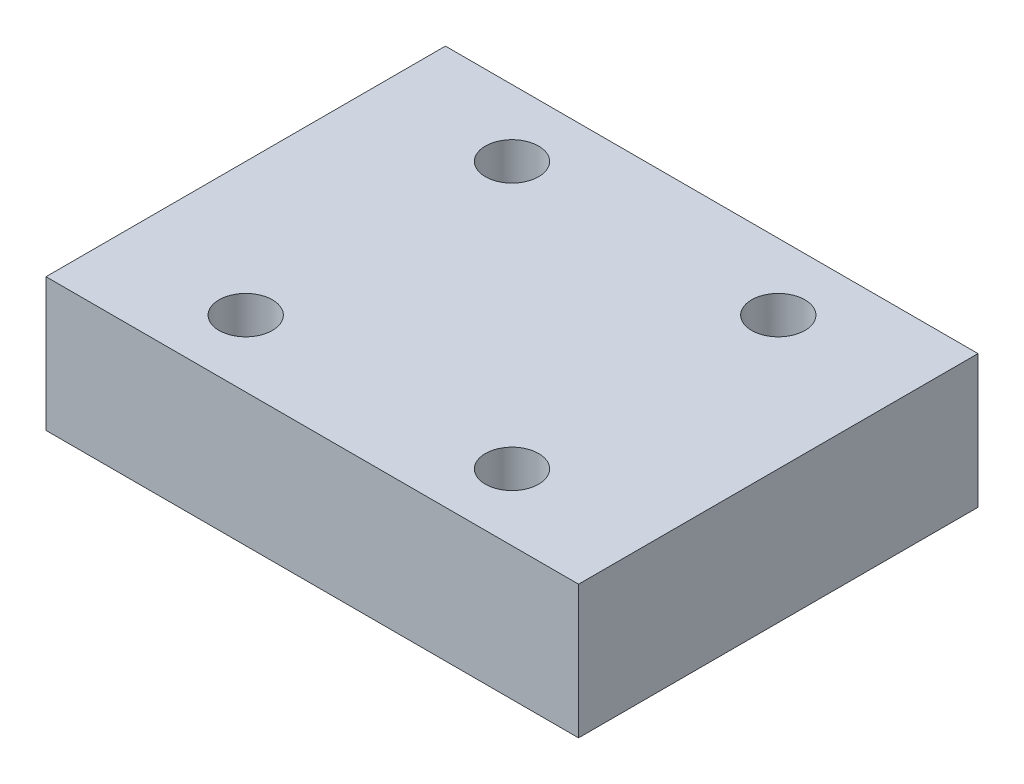
ISO-10303-21;
HEADER;
FILE_DESCRIPTION(('STEP AP214'),'2;1');
FILE_NAME('part.step','',(''),(''),'','','');
FILE_SCHEMA(('AUTOMOTIVE_DESIGN { 1 0 10303 214 1 1 1 1 }'));
ENDSEC;
DATA;
#1=APPLICATION_CONTEXT('core data for automotive mechanical design processes');
#2=APPLICATION_PROTOCOL_DEFINITION('international standard','automotive_design',2000,#1);
#3=PRODUCT_CONTEXT('',#1,'mechanical');
#4=PRODUCT('Part','Part','',(#3));
#5=PRODUCT_RELATED_PRODUCT_CATEGORY('part','',(#4));
#6=PRODUCT_DEFINITION_FORMATION('','',#4);
#7=PRODUCT_DEFINITION_CONTEXT('part definition',#1,'design');
#8=PRODUCT_DEFINITION('design','',#6,#7);
#9=PRODUCT_DEFINITION_SHAPE('','',#8);
#10=(LENGTH_UNIT() NAMED_UNIT(*) SI_UNIT(.MILLI.,.METRE.));
#11=(NAMED_UNIT(*) PLANE_ANGLE_UNIT() SI_UNIT($,.RADIAN.));
#12=(NAMED_UNIT(*) SI_UNIT($,.STERADIAN.) SOLID_ANGLE_UNIT());
#13=UNCERTAINTY_MEASURE_WITH_UNIT(LENGTH_MEASURE(1.E-05),#10,'distance_accuracy_value','');
#14=(GEOMETRIC_REPRESENTATION_CONTEXT(3) GLOBAL_UNCERTAINTY_ASSIGNED_CONTEXT((#13)) GLOBAL_UNIT_ASSIGNED_CONTEXT((#10,
#11,#12)) REPRESENTATION_CONTEXT('',''));
#15=CARTESIAN_POINT('',(0.,0.,0.));
#16=DIRECTION('',(0.,0.,1.));
#17=DIRECTION('',(1.,0.,0.));
#18=AXIS2_PLACEMENT_3D('',#15,#16,#17);
#19=CARTESIAN_POINT('',(-20.,10.,15.));
#20=DIRECTION('',(1.,0.,0.));
#21=DIRECTION('',(0.,0.,-1.));
#22=AXIS2_PLACEMENT_3D('',#19,#20,#21);
#23=PLANE('',#22);
#24=DIRECTION('',(0.,0.,1.));
#25=VECTOR('',#24,1.);
#26=CARTESIAN_POINT('',(-20.,0.,15.));
#27=LINE('',#26,#25);
#28=CARTESIAN_POINT('',(-20.,0.,-15.));
#29=VERTEX_POINT('',#28);
#30=CARTESIAN_POINT('',(-20.,0.,15.));
#31=VERTEX_POINT('',#30);
#32=EDGE_CURVE('E99',#29,#31,#27,.T.);
#33=ORIENTED_EDGE('',*,*,#32,.T.);
#34=DIRECTION('',(0.,-1.,0.));
#35=VECTOR('',#34,1.);
#36=CARTESIAN_POINT('',(-20.,10.,15.));
#37=LINE('',#36,#35);
#38=CARTESIAN_POINT('',(-20.,10.,15.));
#39=VERTEX_POINT('',#38);
#40=EDGE_CURVE('E11',#39,#31,#37,.T.);
#41=ORIENTED_EDGE('',*,*,#40,.F.);
#42=DIRECTION('',(0.,0.,1.));
#43=VECTOR('',#42,1.);
#44=CARTESIAN_POINT('',(-20.,10.,15.));
#45=LINE('',#44,#43);
#46=CARTESIAN_POINT('',(-20.,10.,-15.));
#47=VERTEX_POINT('',#46);
#48=EDGE_CURVE('E86',#47,#39,#45,.T.);
#49=ORIENTED_EDGE('',*,*,#48,.F.);
#50=DIRECTION('',(0.,-1.,0.));
#51=VECTOR('',#50,1.);
#52=CARTESIAN_POINT('',(-20.,10.,-15.));
#53=LINE('',#52,#51);
#54=EDGE_CURVE('E95',#47,#29,#53,.T.);
#55=ORIENTED_EDGE('',*,*,#54,.T.);
#56=EDGE_LOOP('',(#33,#41,#49,#55));
#57=FACE_BOUND('',#56,.T.);
#58=ADVANCED_FACE('F33',(#57),#23,.F.);
#59=CARTESIAN_POINT('',(20.,10.,15.));
#60=DIRECTION('',(0.,0.,-1.));
#61=DIRECTION('',(-1.,0.,0.));
#62=AXIS2_PLACEMENT_3D('',#59,#60,#61);
#63=PLANE('',#62);
#64=DIRECTION('',(1.,0.,0.));
#65=VECTOR('',#64,1.);
#66=CARTESIAN_POINT('',(20.,0.,15.));
#67=LINE('',#66,#65);
#68=CARTESIAN_POINT('',(20.,0.,15.));
#69=VERTEX_POINT('',#68);
#70=EDGE_CURVE('E90',#31,#69,#67,.T.);
#71=ORIENTED_EDGE('',*,*,#70,.T.);
#72=DIRECTION('',(0.,-1.,0.));
#73=VECTOR('',#72,1.);
#74=CARTESIAN_POINT('',(20.,10.,15.));
#75=LINE('',#74,#73);
#76=CARTESIAN_POINT('',(20.,10.,15.));
#77=VERTEX_POINT('',#76);
#78=EDGE_CURVE('E42',#77,#69,#75,.T.);
#79=ORIENTED_EDGE('',*,*,#78,.F.);
#80=DIRECTION('',(1.,0.,0.));
#81=VECTOR('',#80,1.);
#82=CARTESIAN_POINT('',(20.,10.,15.));
#83=LINE('',#82,#81);
#84=EDGE_CURVE('E81',#39,#77,#83,.T.);
#85=ORIENTED_EDGE('',*,*,#84,.F.);
#86=ORIENTED_EDGE('',*,*,#40,.T.);
#87=EDGE_LOOP('',(#71,#79,#85,#86));
#88=FACE_BOUND('',#87,.T.);
#89=ADVANCED_FACE('F89',(#88),#63,.F.);
#90=CARTESIAN_POINT('',(20.,10.,15.));
#91=DIRECTION('',(-1.,0.,0.));
#92=DIRECTION('',(0.,0.,1.));
#93=AXIS2_PLACEMENT_3D('',#90,#91,#92);
#94=PLANE('',#93);
#95=DIRECTION('',(0.,0.,-1.));
#96=VECTOR('',#95,1.);
#97=CARTESIAN_POINT('',(20.,0.,15.));
#98=LINE('',#97,#96);
#99=CARTESIAN_POINT('',(20.,0.,-15.));
#100=VERTEX_POINT('',#99);
#101=EDGE_CURVE('E68',#69,#100,#98,.T.);
#102=ORIENTED_EDGE('',*,*,#101,.T.);
#103=DIRECTION('',(0.,-1.,0.));
#104=VECTOR('',#103,1.);
#105=CARTESIAN_POINT('',(20.,10.,-15.));
#106=LINE('',#105,#104);
#107=CARTESIAN_POINT('',(20.,10.,-15.));
#108=VERTEX_POINT('',#107);
#109=EDGE_CURVE('E91',#108,#100,#106,.T.);
#110=ORIENTED_EDGE('',*,*,#109,.F.);
#111=DIRECTION('',(0.,0.,-1.));
#112=VECTOR('',#111,1.);
#113=CARTESIAN_POINT('',(20.,10.,15.));
#114=LINE('',#113,#112);
#115=EDGE_CURVE('E84',#77,#108,#114,.T.);
#116=ORIENTED_EDGE('',*,*,#115,.F.);
#117=ORIENTED_EDGE('',*,*,#78,.T.);
#118=EDGE_LOOP('',(#102,#110,#116,#117));
#119=FACE_BOUND('',#118,.T.);
#120=ADVANCED_FACE('F93',(#119),#94,.F.);
#121=CARTESIAN_POINT('',(20.,10.,-15.));
#122=DIRECTION('',(0.,0.,1.));
#123=DIRECTION('',(1.,0.,0.));
#124=AXIS2_PLACEMENT_3D('',#121,#122,#123);
#125=PLANE('',#124);
#126=DIRECTION('',(-1.,0.,0.));
#127=VECTOR('',#126,1.);
#128=CARTESIAN_POINT('',(20.,0.,-15.));
#129=LINE('',#128,#127);
#130=EDGE_CURVE('E74',#100,#29,#129,.T.);
#131=ORIENTED_EDGE('',*,*,#130,.T.);
#132=ORIENTED_EDGE('',*,*,#54,.F.);
#133=DIRECTION('',(-1.,0.,0.));
#134=VECTOR('',#133,1.);
#135=CARTESIAN_POINT('',(20.,10.,-15.));
#136=LINE('',#135,#134);
#137=EDGE_CURVE('E51',#108,#47,#136,.T.);
#138=ORIENTED_EDGE('',*,*,#137,.F.);
#139=ORIENTED_EDGE('',*,*,#109,.T.);
#140=EDGE_LOOP('',(#131,#132,#138,#139));
#141=FACE_BOUND('',#140,.T.);
#142=ADVANCED_FACE('F151',(#141),#125,.F.);
#143=CARTESIAN_POINT('',(0.,10.,0.));
#144=DIRECTION('',(0.,1.,0.));
#145=DIRECTION('',(0.,0.,1.));
#146=AXIS2_PLACEMENT_3D('',#143,#144,#145);
#147=PLANE('',#146);
#148=CARTESIAN_POINT('',(-10.,10.,10.));
#149=DIRECTION('',(0.,1.,0.));
#150=DIRECTION('',(0.,0.,-1.));
#151=AXIS2_PLACEMENT_3D('',#148,#149,#150);
#152=CIRCLE('',#151,2.);
#153=CARTESIAN_POINT('',(-10.,10.,8.));
#154=VERTEX_POINT('',#153);
#155=EDGE_CURVE('E217',#154,#154,#152,.T.);
#156=ORIENTED_EDGE('',*,*,#155,.F.);
#157=EDGE_LOOP('',(#156));
#158=FACE_BOUND('',#157,.T.);
#159=CARTESIAN_POINT('',(10.,10.,10.));
#160=DIRECTION('',(0.,1.,0.));
#161=DIRECTION('',(0.,0.,1.));
#162=AXIS2_PLACEMENT_3D('',#159,#160,#161);
#163=CIRCLE('',#162,2.);
#164=CARTESIAN_POINT('',(10.,10.,12.));
#165=VERTEX_POINT('',#164);
#166=EDGE_CURVE('E212',#165,#165,#163,.T.);
#167=ORIENTED_EDGE('',*,*,#166,.F.);
#168=EDGE_LOOP('',(#167));
#169=FACE_BOUND('',#168,.T.);
#170=CARTESIAN_POINT('',(10.,10.,-10.));
#171=DIRECTION('',(0.,1.,0.));
#172=DIRECTION('',(0.,0.,-1.));
#173=AXIS2_PLACEMENT_3D('',#170,#171,#172);
#174=CIRCLE('',#173,2.);
#175=CARTESIAN_POINT('',(10.,10.,-12.));
#176=VERTEX_POINT('',#175);
#177=EDGE_CURVE('E205',#176,#176,#174,.T.);
#178=ORIENTED_EDGE('',*,*,#177,.F.);
#179=EDGE_LOOP('',(#178));
#180=FACE_BOUND('',#179,.T.);
#181=CARTESIAN_POINT('',(-10.,10.,-10.));
#182=DIRECTION('',(0.,1.,0.));
#183=DIRECTION('',(0.,0.,1.));
#184=AXIS2_PLACEMENT_3D('',#181,#182,#183);
#185=CIRCLE('',#184,2.);
#186=CARTESIAN_POINT('',(-10.,10.,-8.));
#187=VERTEX_POINT('',#186);
#188=EDGE_CURVE('E111',#187,#187,#185,.T.);
#189=ORIENTED_EDGE('',*,*,#188,.F.);
#190=EDGE_LOOP('',(#189));
#191=FACE_BOUND('',#190,.T.);
#192=ORIENTED_EDGE('',*,*,#48,.T.);
#193=ORIENTED_EDGE('',*,*,#84,.T.);
#194=ORIENTED_EDGE('',*,*,#115,.T.);
#195=ORIENTED_EDGE('',*,*,#137,.T.);
#196=EDGE_LOOP('',(#192,#193,#194,#195));
#197=FACE_BOUND('',#196,.T.);
#198=ADVANCED_FACE('F82',(#158,#169,#180,#191,#197),#147,.T.);
#199=CARTESIAN_POINT('',(0.,0.,0.));
#200=DIRECTION('',(0.,1.,0.));
#201=DIRECTION('',(0.,0.,1.));
#202=AXIS2_PLACEMENT_3D('',#199,#200,#201);
#203=PLANE('',#202);
#204=CARTESIAN_POINT('',(-10.,0.,10.));
#205=DIRECTION('',(0.,1.,0.));
#206=DIRECTION('',(0.,0.,1.));
#207=AXIS2_PLACEMENT_3D('',#204,#205,#206);
#208=CIRCLE('',#207,2.);
#209=CARTESIAN_POINT('',(-10.,0.,12.));
#210=VERTEX_POINT('',#209);
#211=EDGE_CURVE('E36',#210,#210,#208,.T.);
#212=ORIENTED_EDGE('',*,*,#211,.T.);
#213=EDGE_LOOP('',(#212));
#214=FACE_BOUND('',#213,.T.);
#215=CARTESIAN_POINT('',(10.,0.,10.));
#216=DIRECTION('',(0.,1.,0.));
#217=DIRECTION('',(0.,0.,1.));
#218=AXIS2_PLACEMENT_3D('',#215,#216,#217);
#219=CIRCLE('',#218,2.);
#220=CARTESIAN_POINT('',(10.,0.,12.));
#221=VERTEX_POINT('',#220);
#222=EDGE_CURVE('E113',#221,#221,#219,.T.);
#223=ORIENTED_EDGE('',*,*,#222,.T.);
#224=EDGE_LOOP('',(#223));
#225=FACE_BOUND('',#224,.T.);
#226=CARTESIAN_POINT('',(10.,0.,-10.));
#227=DIRECTION('',(0.,1.,0.));
#228=DIRECTION('',(0.,0.,1.));
#229=AXIS2_PLACEMENT_3D('',#226,#227,#228);
#230=CIRCLE('',#229,2.);
#231=CARTESIAN_POINT('',(10.,0.,-8.));
#232=VERTEX_POINT('',#231);
#233=EDGE_CURVE('E110',#232,#232,#230,.T.);
#234=ORIENTED_EDGE('',*,*,#233,.T.);
#235=EDGE_LOOP('',(#234));
#236=FACE_BOUND('',#235,.T.);
#237=CARTESIAN_POINT('',(-10.,0.,-10.));
#238=DIRECTION('',(0.,1.,0.));
#239=DIRECTION('',(0.,0.,1.));
#240=AXIS2_PLACEMENT_3D('',#237,#238,#239);
#241=CIRCLE('',#240,2.);
#242=CARTESIAN_POINT('',(-10.,0.,-8.));
#243=VERTEX_POINT('',#242);
#244=EDGE_CURVE('E107',#243,#243,#241,.T.);
#245=ORIENTED_EDGE('',*,*,#244,.T.);
#246=EDGE_LOOP('',(#245));
#247=FACE_BOUND('',#246,.T.);
#248=ORIENTED_EDGE('',*,*,#32,.F.);
#249=ORIENTED_EDGE('',*,*,#130,.F.);
#250=ORIENTED_EDGE('',*,*,#101,.F.);
#251=ORIENTED_EDGE('',*,*,#70,.F.);
#252=EDGE_LOOP('',(#248,#249,#250,#251));
#253=FACE_BOUND('',#252,.T.);
#254=ADVANCED_FACE('F120',(#214,#225,#236,#247,#253),#203,.F.);
#255=CARTESIAN_POINT('',(-10.,-6.,-10.));
#256=DIRECTION('',(0.,1.,0.));
#257=DIRECTION('',(0.,0.,1.));
#258=AXIS2_PLACEMENT_3D('',#255,#256,#257);
#259=CYLINDRICAL_SURFACE('',#258,2.);
#260=ORIENTED_EDGE('',*,*,#188,.T.);
#261=EDGE_LOOP('',(#260));
#262=FACE_BOUND('',#261,.T.);
#263=ORIENTED_EDGE('',*,*,#244,.F.);
#264=EDGE_LOOP('',(#263));
#265=FACE_BOUND('',#264,.T.);
#266=ADVANCED_FACE('F143',(#262,#265),#259,.F.);
#267=CARTESIAN_POINT('',(10.,-6.,-10.));
#268=DIRECTION('',(0.,1.,0.));
#269=DIRECTION('',(0.,0.,1.));
#270=AXIS2_PLACEMENT_3D('',#267,#268,#269);
#271=CYLINDRICAL_SURFACE('',#270,2.);
#272=ORIENTED_EDGE('',*,*,#177,.T.);
#273=EDGE_LOOP('',(#272));
#274=FACE_BOUND('',#273,.T.);
#275=ORIENTED_EDGE('',*,*,#233,.F.);
#276=EDGE_LOOP('',(#275));
#277=FACE_BOUND('',#276,.T.);
#278=ADVANCED_FACE('F130',(#274,#277),#271,.F.);
#279=CARTESIAN_POINT('',(10.,-6.,10.));
#280=DIRECTION('',(0.,1.,0.));
#281=DIRECTION('',(0.,0.,1.));
#282=AXIS2_PLACEMENT_3D('',#279,#280,#281);
#283=CYLINDRICAL_SURFACE('',#282,2.);
#284=ORIENTED_EDGE('',*,*,#166,.T.);
#285=EDGE_LOOP('',(#284));
#286=FACE_BOUND('',#285,.T.);
#287=ORIENTED_EDGE('',*,*,#222,.F.);
#288=EDGE_LOOP('',(#287));
#289=FACE_BOUND('',#288,.T.);
#290=ADVANCED_FACE('F124',(#286,#289),#283,.F.);
#291=CARTESIAN_POINT('',(-10.,-6.,10.));
#292=DIRECTION('',(0.,1.,0.));
#293=DIRECTION('',(0.,0.,1.));
#294=AXIS2_PLACEMENT_3D('',#291,#292,#293);
#295=CYLINDRICAL_SURFACE('',#294,2.);
#296=ORIENTED_EDGE('',*,*,#155,.T.);
#297=EDGE_LOOP('',(#296));
#298=FACE_BOUND('',#297,.T.);
#299=ORIENTED_EDGE('',*,*,#211,.F.);
#300=EDGE_LOOP('',(#299));
#301=FACE_BOUND('',#300,.T.);
#302=ADVANCED_FACE('F122',(#298,#301),#295,.F.);
#303=CLOSED_SHELL('',(#58,#89,#120,#142,#198,#254,#266,#278,#290,#302));
#304=MANIFOLD_SOLID_BREP('B2',#303);
#305=ADVANCED_BREP_SHAPE_REPRESENTATION('',(#18,#304),#14);
#306=SHAPE_DEFINITION_REPRESENTATION(#9,#305);
ENDSEC;
END-ISO-10303-21;
